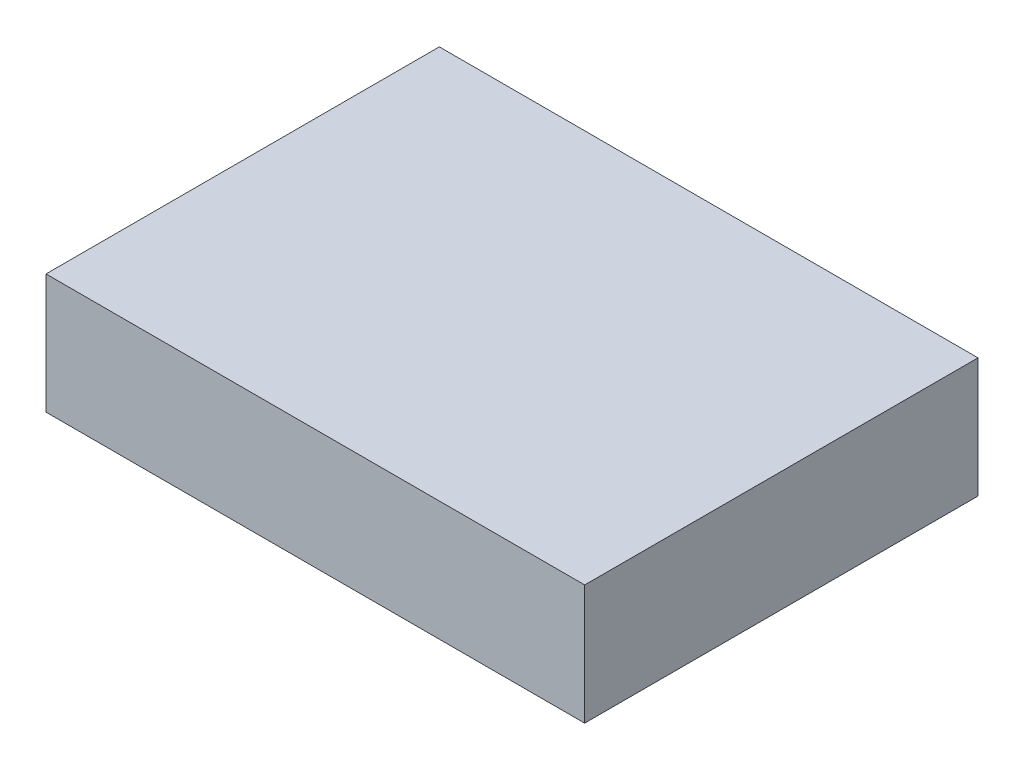
ISO-10303-21;
HEADER;
FILE_DESCRIPTION(('STEP AP214'),'2;1');
FILE_NAME('part.step','',(''),(''),'','','');
FILE_SCHEMA(('AUTOMOTIVE_DESIGN { 1 0 10303 214 1 1 1 1 }'));
ENDSEC;
DATA;
#1=APPLICATION_CONTEXT('core data for automotive mechanical design processes');
#2=APPLICATION_PROTOCOL_DEFINITION('international standard','automotive_design',2000,#1);
#3=PRODUCT_CONTEXT('',#1,'mechanical');
#4=PRODUCT('Part','Part','',(#3));
#5=PRODUCT_RELATED_PRODUCT_CATEGORY('part','',(#4));
#6=PRODUCT_DEFINITION_FORMATION('','',#4);
#7=PRODUCT_DEFINITION_CONTEXT('part definition',#1,'design');
#8=PRODUCT_DEFINITION('design','',#6,#7);
#9=PRODUCT_DEFINITION_SHAPE('','',#8);
#10=(LENGTH_UNIT() NAMED_UNIT(*) SI_UNIT(.MILLI.,.METRE.));
#11=(NAMED_UNIT(*) PLANE_ANGLE_UNIT() SI_UNIT($,.RADIAN.));
#12=(NAMED_UNIT(*) SI_UNIT($,.STERADIAN.) SOLID_ANGLE_UNIT());
#13=UNCERTAINTY_MEASURE_WITH_UNIT(LENGTH_MEASURE(1.E-05),#10,'distance_accuracy_value','');
#14=(GEOMETRIC_REPRESENTATION_CONTEXT(3) GLOBAL_UNCERTAINTY_ASSIGNED_CONTEXT((#13)) GLOBAL_UNIT_ASSIGNED_CONTEXT((#10,
#11,#12)) REPRESENTATION_CONTEXT('',''));
#15=CARTESIAN_POINT('',(0.,0.,0.));
#16=DIRECTION('',(0.,0.,1.));
#17=DIRECTION('',(1.,0.,0.));
#18=AXIS2_PLACEMENT_3D('',#15,#16,#17);
#19=CARTESIAN_POINT('',(0.,0.,0.));
#20=DIRECTION('',(0.,1.,0.));
#21=DIRECTION('',(0.,0.,1.));
#22=AXIS2_PLACEMENT_3D('',#19,#20,#21);
#23=PLANE('',#22);
#24=DIRECTION('',(1.,0.,0.));
#25=VECTOR('',#24,1.);
#26=CARTESIAN_POINT('',(157.5,0.,-115.));
#27=LINE('',#26,#25);
#28=CARTESIAN_POINT('',(-157.5,0.,-115.));
#29=VERTEX_POINT('',#28);
#30=CARTESIAN_POINT('',(157.5,0.,-115.));
#31=VERTEX_POINT('',#30);
#32=EDGE_CURVE('E81',#29,#31,#27,.T.);
#33=ORIENTED_EDGE('',*,*,#32,.T.);
#34=DIRECTION('',(0.,0.,1.));
#35=VECTOR('',#34,1.);
#36=CARTESIAN_POINT('',(157.5,0.,115.));
#37=LINE('',#36,#35);
#38=CARTESIAN_POINT('',(157.5,0.,115.));
#39=VERTEX_POINT('',#38);
#40=EDGE_CURVE('E68',#31,#39,#37,.T.);
#41=ORIENTED_EDGE('',*,*,#40,.T.);
#42=DIRECTION('',(-1.,0.,0.));
#43=VECTOR('',#42,1.);
#44=CARTESIAN_POINT('',(157.5,0.,115.));
#45=LINE('',#44,#43);
#46=CARTESIAN_POINT('',(-157.5,0.,115.));
#47=VERTEX_POINT('',#46);
#48=EDGE_CURVE('E55',#39,#47,#45,.T.);
#49=ORIENTED_EDGE('',*,*,#48,.T.);
#50=DIRECTION('',(0.,0.,-1.));
#51=VECTOR('',#50,1.);
#52=CARTESIAN_POINT('',(-157.5,0.,115.));
#53=LINE('',#52,#51);
#54=EDGE_CURVE('E20',#47,#29,#53,.T.);
#55=ORIENTED_EDGE('',*,*,#54,.T.);
#56=EDGE_LOOP('',(#33,#41,#49,#55));
#57=FACE_BOUND('',#56,.T.);
#58=ADVANCED_FACE('F17',(#57),#23,.F.);
#59=CARTESIAN_POINT('',(-157.5,70.,115.));
#60=DIRECTION('',(1.,0.,0.));
#61=DIRECTION('',(0.,0.,-1.));
#62=AXIS2_PLACEMENT_3D('',#59,#60,#61);
#63=PLANE('',#62);
#64=DIRECTION('',(0.,1.,0.));
#65=VECTOR('',#64,1.);
#66=CARTESIAN_POINT('',(-157.5,70.,115.));
#67=LINE('',#66,#65);
#68=CARTESIAN_POINT('',(-157.5,70.,115.));
#69=VERTEX_POINT('',#68);
#70=EDGE_CURVE('E61',#47,#69,#67,.T.);
#71=ORIENTED_EDGE('',*,*,#70,.T.);
#72=DIRECTION('',(0.,0.,1.));
#73=VECTOR('',#72,1.);
#74=CARTESIAN_POINT('',(-157.5,70.,0.));
#75=LINE('',#74,#73);
#76=CARTESIAN_POINT('',(-157.5,70.,-115.));
#77=VERTEX_POINT('',#76);
#78=EDGE_CURVE('E83',#77,#69,#75,.T.);
#79=ORIENTED_EDGE('',*,*,#78,.F.);
#80=DIRECTION('',(0.,1.,0.));
#81=VECTOR('',#80,1.);
#82=CARTESIAN_POINT('',(-157.5,70.,-115.));
#83=LINE('',#82,#81);
#84=EDGE_CURVE('E64',#77,#29,#83,.F.);
#85=ORIENTED_EDGE('',*,*,#84,.T.);
#86=ORIENTED_EDGE('',*,*,#54,.F.);
#87=EDGE_LOOP('',(#71,#79,#85,#86));
#88=FACE_BOUND('',#87,.T.);
#89=ADVANCED_FACE('F60',(#88),#63,.F.);
#90=CARTESIAN_POINT('',(157.5,70.,115.));
#91=DIRECTION('',(0.,0.,-1.));
#92=DIRECTION('',(-1.,0.,0.));
#93=AXIS2_PLACEMENT_3D('',#90,#91,#92);
#94=PLANE('',#93);
#95=DIRECTION('',(0.,1.,0.));
#96=VECTOR('',#95,1.);
#97=CARTESIAN_POINT('',(157.5,70.,115.));
#98=LINE('',#97,#96);
#99=CARTESIAN_POINT('',(157.5,70.,115.));
#100=VERTEX_POINT('',#99);
#101=EDGE_CURVE('E70',#39,#100,#98,.T.);
#102=ORIENTED_EDGE('',*,*,#101,.T.);
#103=DIRECTION('',(1.,0.,0.));
#104=VECTOR('',#103,1.);
#105=CARTESIAN_POINT('',(0.,70.,115.));
#106=LINE('',#105,#104);
#107=EDGE_CURVE('E74',#69,#100,#106,.T.);
#108=ORIENTED_EDGE('',*,*,#107,.F.);
#109=ORIENTED_EDGE('',*,*,#70,.F.);
#110=ORIENTED_EDGE('',*,*,#48,.F.);
#111=EDGE_LOOP('',(#102,#108,#109,#110));
#112=FACE_BOUND('',#111,.T.);
#113=ADVANCED_FACE('F72',(#112),#94,.F.);
#114=CARTESIAN_POINT('',(157.5,70.,115.));
#115=DIRECTION('',(-1.,0.,0.));
#116=DIRECTION('',(0.,0.,1.));
#117=AXIS2_PLACEMENT_3D('',#114,#115,#116);
#118=PLANE('',#117);
#119=DIRECTION('',(0.,1.,0.));
#120=VECTOR('',#119,1.);
#121=CARTESIAN_POINT('',(157.5,70.,-115.));
#122=LINE('',#121,#120);
#123=CARTESIAN_POINT('',(157.5,70.,-115.));
#124=VERTEX_POINT('',#123);
#125=EDGE_CURVE('E35',#31,#124,#122,.T.);
#126=ORIENTED_EDGE('',*,*,#125,.T.);
#127=DIRECTION('',(0.,0.,1.));
#128=VECTOR('',#127,1.);
#129=CARTESIAN_POINT('',(157.5,70.,0.));
#130=LINE('',#129,#128);
#131=EDGE_CURVE('E26',#100,#124,#130,.F.);
#132=ORIENTED_EDGE('',*,*,#131,.F.);
#133=ORIENTED_EDGE('',*,*,#101,.F.);
#134=ORIENTED_EDGE('',*,*,#40,.F.);
#135=EDGE_LOOP('',(#126,#132,#133,#134));
#136=FACE_BOUND('',#135,.T.);
#137=ADVANCED_FACE('F89',(#136),#118,.F.);
#138=CARTESIAN_POINT('',(157.5,70.,-115.));
#139=DIRECTION('',(0.,0.,1.));
#140=DIRECTION('',(1.,0.,0.));
#141=AXIS2_PLACEMENT_3D('',#138,#139,#140);
#142=PLANE('',#141);
#143=ORIENTED_EDGE('',*,*,#84,.F.);
#144=DIRECTION('',(1.,0.,0.));
#145=VECTOR('',#144,1.);
#146=CARTESIAN_POINT('',(0.,70.,-115.));
#147=LINE('',#146,#145);
#148=EDGE_CURVE('E11',#124,#77,#147,.F.);
#149=ORIENTED_EDGE('',*,*,#148,.F.);
#150=ORIENTED_EDGE('',*,*,#125,.F.);
#151=ORIENTED_EDGE('',*,*,#32,.F.);
#152=EDGE_LOOP('',(#143,#149,#150,#151));
#153=FACE_BOUND('',#152,.T.);
#154=ADVANCED_FACE('F91',(#153),#142,.F.);
#155=CARTESIAN_POINT('',(0.,70.,0.));
#156=DIRECTION('',(0.,1.,0.));
#157=DIRECTION('',(0.,0.,1.));
#158=AXIS2_PLACEMENT_3D('',#155,#156,#157);
#159=PLANE('',#158);
#160=ORIENTED_EDGE('',*,*,#131,.T.);
#161=ORIENTED_EDGE('',*,*,#148,.T.);
#162=ORIENTED_EDGE('',*,*,#78,.T.);
#163=ORIENTED_EDGE('',*,*,#107,.T.);
#164=EDGE_LOOP('',(#160,#161,#162,#163));
#165=FACE_BOUND('',#164,.T.);
#166=ADVANCED_FACE('F88',(#165),#159,.T.);
#167=CLOSED_SHELL('',(#58,#89,#113,#137,#154,#166));
#168=MANIFOLD_SOLID_BREP('B1',#167);
#169=ADVANCED_BREP_SHAPE_REPRESENTATION('',(#18,#168),#14);
#170=SHAPE_DEFINITION_REPRESENTATION(#9,#169);
ENDSEC;
END-ISO-10303-21;
